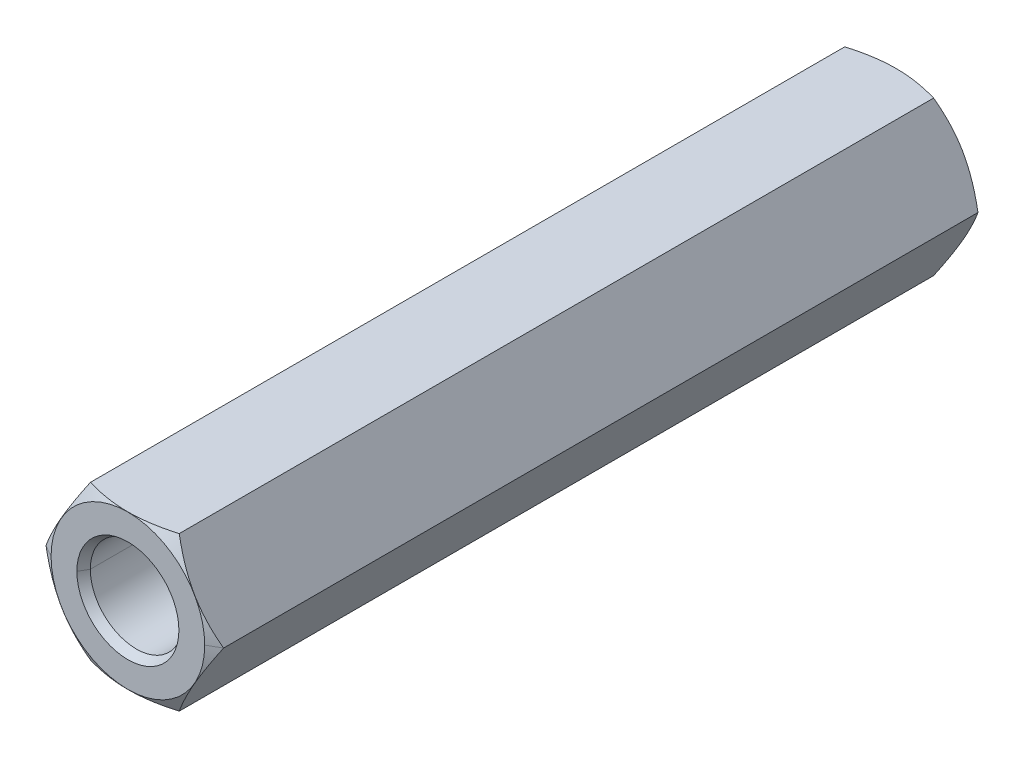
ISO-10303-21;
HEADER;
FILE_DESCRIPTION(('STEP AP214'),'2;1');
FILE_NAME('part.step','',(''),(''),'','','');
FILE_SCHEMA(('AUTOMOTIVE_DESIGN { 1 0 10303 214 1 1 1 1 }'));
ENDSEC;
DATA;
#1=APPLICATION_CONTEXT('core data for automotive mechanical design processes');
#2=APPLICATION_PROTOCOL_DEFINITION('international standard','automotive_design',2000,#1);
#3=PRODUCT_CONTEXT('',#1,'mechanical');
#4=PRODUCT('Part','Part','',(#3));
#5=PRODUCT_RELATED_PRODUCT_CATEGORY('part','',(#4));
#6=PRODUCT_DEFINITION_FORMATION('','',#4);
#7=PRODUCT_DEFINITION_CONTEXT('part definition',#1,'design');
#8=PRODUCT_DEFINITION('design','',#6,#7);
#9=PRODUCT_DEFINITION_SHAPE('','',#8);
#10=(LENGTH_UNIT() NAMED_UNIT(*) SI_UNIT(.MILLI.,.METRE.));
#11=(NAMED_UNIT(*) PLANE_ANGLE_UNIT() SI_UNIT($,.RADIAN.));
#12=(NAMED_UNIT(*) SI_UNIT($,.STERADIAN.) SOLID_ANGLE_UNIT());
#13=UNCERTAINTY_MEASURE_WITH_UNIT(LENGTH_MEASURE(1.E-05),#10,'distance_accuracy_value','');
#14=(GEOMETRIC_REPRESENTATION_CONTEXT(3) GLOBAL_UNCERTAINTY_ASSIGNED_CONTEXT((#13)) GLOBAL_UNIT_ASSIGNED_CONTEXT((#10,
#11,#12)) REPRESENTATION_CONTEXT('',''));
#15=CARTESIAN_POINT('',(0.,0.,0.));
#16=DIRECTION('',(0.,0.,1.));
#17=DIRECTION('',(1.,0.,0.));
#18=AXIS2_PLACEMENT_3D('',#15,#16,#17);
#19=CARTESIAN_POINT('',(220.318744279938,128.56204329235,150.447608312383));
#20=DIRECTION('',(0.,0.,-1.));
#21=DIRECTION('',(1.,0.,0.));
#22=AXIS2_PLACEMENT_3D('',#19,#20,#21);
#23=CONICAL_SURFACE('',#22,1.7320508075705,1.047197551197);
#24=DIRECTION('',(0.86602540378464,0.,-0.499999999999652));
#25=VECTOR('',#24,1.);
#26=CARTESIAN_POINT('',(222.050795087508,128.56204329235,150.447608312383));
#27=LINE('',#26,#25);
#28=CARTESIAN_POINT('',(220.318744279938,128.56204329235,151.447608312383));
#29=VERTEX_POINT('',#28);
#30=CARTESIAN_POINT('',(221.818744279938,128.56204329235,150.581582908599));
#31=VERTEX_POINT('',#30);
#32=EDGE_CURVE('E67',#29,#31,#27,.T.);
#33=ORIENTED_EDGE('',*,*,#32,.F.);
#34=DIRECTION('',(-0.86602540378464,0.,-0.499999999999652));
#35=VECTOR('',#34,1.);
#36=CARTESIAN_POINT('',(218.586693472367,128.56204329235,150.447608312383));
#37=LINE('',#36,#35);
#38=CARTESIAN_POINT('',(218.818744279938,128.56204329235,150.581582908599));
#39=VERTEX_POINT('',#38);
#40=EDGE_CURVE('E11',#29,#39,#37,.T.);
#41=ORIENTED_EDGE('',*,*,#40,.T.);
#42=CARTESIAN_POINT('',(220.318744279938,128.56204329235,150.581582908599));
#43=DIRECTION('',(0.,0.,1.));
#44=DIRECTION('',(1.,0.,0.));
#45=AXIS2_PLACEMENT_3D('',#42,#43,#44);
#46=CIRCLE('',#45,1.5);
#47=EDGE_CURVE('E55',#31,#39,#46,.T.);
#48=ORIENTED_EDGE('',*,*,#47,.F.);
#49=EDGE_LOOP('',(#33,#41,#48));
#50=FACE_BOUND('',#49,.T.);
#51=ADVANCED_FACE('F44',(#50),#23,.F.);
#52=CARTESIAN_POINT('',(220.318744279938,128.56204329235,150.581582908599));
#53=DIRECTION('',(0.,0.,-1.));
#54=DIRECTION('',(1.,0.,0.));
#55=AXIS2_PLACEMENT_3D('',#52,#53,#54);
#56=CYLINDRICAL_SURFACE('',#55,1.5);
#57=ORIENTED_EDGE('',*,*,#47,.T.);
#58=DIRECTION('',(0.,0.,-1.));
#59=VECTOR('',#58,1.);
#60=CARTESIAN_POINT('',(218.818744279938,128.56204329235,150.581582908599));
#61=LINE('',#60,#59);
#62=CARTESIAN_POINT('',(218.818744279938,128.56204329235,140.858711037809));
#63=VERTEX_POINT('',#62);
#64=EDGE_CURVE('E269',#39,#63,#61,.T.);
#65=ORIENTED_EDGE('',*,*,#64,.T.);
#66=CARTESIAN_POINT('',(220.318744279938,128.56204329235,140.858711037809));
#67=DIRECTION('',(0.,0.,1.));
#68=DIRECTION('',(1.,0.,0.));
#69=AXIS2_PLACEMENT_3D('',#66,#67,#68);
#70=CIRCLE('',#69,1.5);
#71=CARTESIAN_POINT('',(221.818744279938,128.56204329235,140.858711037809));
#72=VERTEX_POINT('',#71);
#73=EDGE_CURVE('E300',#72,#63,#70,.T.);
#74=ORIENTED_EDGE('',*,*,#73,.F.);
#75=DIRECTION('',(0.,0.,-1.));
#76=VECTOR('',#75,1.);
#77=CARTESIAN_POINT('',(221.818744279938,128.56204329235,150.581582908599));
#78=LINE('',#77,#76);
#79=EDGE_CURVE('E237',#31,#72,#78,.T.);
#80=ORIENTED_EDGE('',*,*,#79,.F.);
#81=EDGE_LOOP('',(#57,#65,#74,#80));
#82=FACE_BOUND('',#81,.T.);
#83=ADVANCED_FACE('F491',(#82),#56,.F.);
#84=CARTESIAN_POINT('',(220.318744279938,128.56204329235,140.858711037809));
#85=DIRECTION('',(0.,0.,-1.));
#86=DIRECTION('',(1.,0.,0.));
#87=AXIS2_PLACEMENT_3D('',#84,#85,#86);
#88=CONICAL_SURFACE('',#87,1.5,0.5235987756);
#89=ORIENTED_EDGE('',*,*,#73,.T.);
#90=DIRECTION('',(-0.500000000001473,0.,-0.866025403783588));
#91=VECTOR('',#90,1.);
#92=CARTESIAN_POINT('',(218.818744279938,128.56204329235,140.858711037809));
#93=LINE('',#92,#91);
#94=CARTESIAN_POINT('',(218.658744279937,128.56204329235,140.581582908599));
#95=VERTEX_POINT('',#94);
#96=EDGE_CURVE('E307',#63,#95,#93,.T.);
#97=ORIENTED_EDGE('',*,*,#96,.T.);
#98=CARTESIAN_POINT('',(220.318744279938,128.56204329235,140.581582908599));
#99=DIRECTION('',(0.,0.,1.));
#100=DIRECTION('',(1.,0.,0.));
#101=AXIS2_PLACEMENT_3D('',#98,#99,#100);
#102=CIRCLE('',#101,1.66);
#103=CARTESIAN_POINT('',(221.978744279938,128.56204329235,140.581582908599));
#104=VERTEX_POINT('',#103);
#105=EDGE_CURVE('E274',#104,#95,#102,.T.);
#106=ORIENTED_EDGE('',*,*,#105,.F.);
#107=DIRECTION('',(0.500000000001473,0.,-0.866025403783588));
#108=VECTOR('',#107,1.);
#109=CARTESIAN_POINT('',(221.818744279938,128.56204329235,140.858711037809));
#110=LINE('',#109,#108);
#111=EDGE_CURVE('E236',#72,#104,#110,.T.);
#112=ORIENTED_EDGE('',*,*,#111,.F.);
#113=EDGE_LOOP('',(#89,#97,#106,#112));
#114=FACE_BOUND('',#113,.T.);
#115=ADVANCED_FACE('F496',(#114),#88,.F.);
#116=CARTESIAN_POINT('',(220.318744279938,128.56204329235,140.581582908599));
#117=DIRECTION('',(0.,0.,1.));
#118=DIRECTION('',(1.,0.,0.));
#119=AXIS2_PLACEMENT_3D('',#116,#117,#118);
#120=CONICAL_SURFACE('',#119,2.5,1.047197551197);
#121=CARTESIAN_POINT('',(220.318744279938,128.56204329235,140.581582908599));
#122=DIRECTION('',(0.,0.,1.));
#123=DIRECTION('',(1.,0.,0.));
#124=AXIS2_PLACEMENT_3D('',#121,#122,#123);
#125=CIRCLE('',#124,2.5);
#126=CARTESIAN_POINT('',(222.818744279938,128.56204329235,140.581582908599));
#127=VERTEX_POINT('',#126);
#128=CARTESIAN_POINT('',(217.818744279938,128.56204329235,140.581582908599));
#129=VERTEX_POINT('',#128);
#130=EDGE_CURVE('E244',#127,#129,#125,.T.);
#131=ORIENTED_EDGE('',*,*,#130,.T.);
#132=DIRECTION('',(-0.86602540378464,0.,0.499999999999652));
#133=VECTOR('',#132,1.);
#134=CARTESIAN_POINT('',(217.818744279938,128.56204329235,140.581582908599));
#135=LINE('',#134,#133);
#136=CARTESIAN_POINT('',(217.428744279937,128.56204329235,140.806749513583));
#137=VERTEX_POINT('',#136);
#138=EDGE_CURVE('E186',#129,#137,#135,.T.);
#139=ORIENTED_EDGE('',*,*,#138,.T.);
#140=CARTESIAN_POINT('',(218.873744279938,131.064856709287,140.806749513583));
#141=CARTESIAN_POINT('',(218.151244279938,129.813450000819,140.389613944093));
#142=CARTESIAN_POINT('',(217.428744279937,128.56204329235,140.806749513583));
#143=(BOUNDED_CURVE() B_SPLINE_CURVE(2,(#140,#141,#142),.UNSPECIFIED.,.F.,
.F.) B_SPLINE_CURVE_WITH_KNOTS((3,3),(0.,1.),
.UNSPECIFIED.) CURVE() GEOMETRIC_REPRESENTATION_ITEM() RATIONAL_B_SPLINE_CURVE((1.,
1.15470053837935,1.)) REPRESENTATION_ITEM(''));
#144=CARTESIAN_POINT('',(218.873744279938,131.064856709287,140.806749513583));
#145=VERTEX_POINT('',#144);
#146=EDGE_CURVE('E183',#145,#137,#143,.T.);
#147=ORIENTED_EDGE('',*,*,#146,.F.);
#148=CARTESIAN_POINT('',(221.763744279937,131.064856709287,140.806749513583));
#149=CARTESIAN_POINT('',(220.318744279938,131.064856709288,140.389613944093));
#150=CARTESIAN_POINT('',(218.873744279938,131.064856709287,140.806749513583));
#151=(BOUNDED_CURVE() B_SPLINE_CURVE(2,(#148,#149,#150),.UNSPECIFIED.,.F.,
.F.) B_SPLINE_CURVE_WITH_KNOTS((3,3),(0.,1.),
.UNSPECIFIED.) CURVE() GEOMETRIC_REPRESENTATION_ITEM() RATIONAL_B_SPLINE_CURVE((1.,
1.15470053837926,1.)) REPRESENTATION_ITEM(''));
#152=CARTESIAN_POINT('',(221.763744279937,131.064856709287,140.806749513583));
#153=VERTEX_POINT('',#152);
#154=EDGE_CURVE('E170',#153,#145,#151,.T.);
#155=ORIENTED_EDGE('',*,*,#154,.F.);
#156=CARTESIAN_POINT('',(223.208744279937,128.56204329235,140.806749513583));
#157=CARTESIAN_POINT('',(222.486244279938,129.813450000819,140.389613944093));
#158=CARTESIAN_POINT('',(221.763744279937,131.064856709287,140.806749513583));
#159=(BOUNDED_CURVE() B_SPLINE_CURVE(2,(#156,#157,#158),.UNSPECIFIED.,.F.,
.F.) B_SPLINE_CURVE_WITH_KNOTS((3,3),(0.,1.),
.UNSPECIFIED.) CURVE() GEOMETRIC_REPRESENTATION_ITEM() RATIONAL_B_SPLINE_CURVE((1.,
1.15470053837946,1.)) REPRESENTATION_ITEM(''));
#160=CARTESIAN_POINT('',(223.208744279937,128.56204329235,140.806749513583));
#161=VERTEX_POINT('',#160);
#162=EDGE_CURVE('E210',#161,#153,#159,.T.);
#163=ORIENTED_EDGE('',*,*,#162,.F.);
#164=DIRECTION('',(0.86602540378464,0.,0.499999999999652));
#165=VECTOR('',#164,1.);
#166=CARTESIAN_POINT('',(222.818744279938,128.56204329235,140.581582908599));
#167=LINE('',#166,#165);
#168=EDGE_CURVE('E270',#127,#161,#167,.T.);
#169=ORIENTED_EDGE('',*,*,#168,.F.);
#170=EDGE_LOOP('',(#131,#139,#147,#155,#163,#169));
#171=FACE_BOUND('',#170,.T.);
#172=ADVANCED_FACE('F185',(#171),#120,.T.);
#173=CARTESIAN_POINT('',(220.318744279938,128.56204329235,165.356416303615));
#174=DIRECTION('',(0.,0.,-1.));
#175=DIRECTION('',(1.,0.,0.));
#176=AXIS2_PLACEMENT_3D('',#173,#174,#175);
#177=CONICAL_SURFACE('',#176,2.89,1.047197551197);
#178=CARTESIAN_POINT('',(220.318744279938,128.56204329235,165.581582908599));
#179=DIRECTION('',(0.,0.,1.));
#180=DIRECTION('',(1.,0.,0.));
#181=AXIS2_PLACEMENT_3D('',#178,#179,#180);
#182=CIRCLE('',#181,2.5);
#183=CARTESIAN_POINT('',(217.818744279938,128.56204329235,165.581582908599));
#184=VERTEX_POINT('',#183);
#185=CARTESIAN_POINT('',(222.818744279938,128.56204329235,165.581582908599));
#186=VERTEX_POINT('',#185);
#187=EDGE_CURVE('E256',#184,#186,#182,.T.);
#188=ORIENTED_EDGE('',*,*,#187,.F.);
#189=DIRECTION('',(-0.86602540378464,0.,-0.499999999999652));
#190=VECTOR('',#189,1.);
#191=CARTESIAN_POINT('',(217.428744279937,128.56204329235,165.356416303615));
#192=LINE('',#191,#190);
#193=CARTESIAN_POINT('',(217.428744279937,128.56204329235,165.356416303615));
#194=VERTEX_POINT('',#193);
#195=EDGE_CURVE('E245',#184,#194,#192,.T.);
#196=ORIENTED_EDGE('',*,*,#195,.T.);
#197=CARTESIAN_POINT('',(218.873744279938,126.059229875413,165.356416303615));
#198=CARTESIAN_POINT('',(218.151244279937,127.310636583881,165.773551873104));
#199=CARTESIAN_POINT('',(217.428744279937,128.56204329235,165.356416303615));
#200=(BOUNDED_CURVE() B_SPLINE_CURVE(2,(#197,#198,#199),.UNSPECIFIED.,.F.,
.F.) B_SPLINE_CURVE_WITH_KNOTS((3,3),(0.,1.),
.UNSPECIFIED.) CURVE() GEOMETRIC_REPRESENTATION_ITEM() RATIONAL_B_SPLINE_CURVE((1.,
1.15470053837936,1.)) REPRESENTATION_ITEM(''));
#201=CARTESIAN_POINT('',(218.873744279938,126.059229875413,165.356416303615));
#202=VERTEX_POINT('',#201);
#203=EDGE_CURVE('E216',#202,#194,#200,.T.);
#204=ORIENTED_EDGE('',*,*,#203,.F.);
#205=CARTESIAN_POINT('',(221.763744279937,126.059229875413,165.356416303615));
#206=CARTESIAN_POINT('',(220.318744279938,126.059229875413,165.773551873104));
#207=CARTESIAN_POINT('',(218.873744279938,126.059229875413,165.356416303615));
#208=(BOUNDED_CURVE() B_SPLINE_CURVE(2,(#205,#206,#207),.UNSPECIFIED.,.F.,
.F.) B_SPLINE_CURVE_WITH_KNOTS((3,3),(0.,1.),
.UNSPECIFIED.) CURVE() GEOMETRIC_REPRESENTATION_ITEM() RATIONAL_B_SPLINE_CURVE((1.,
1.15470053837925,1.)) REPRESENTATION_ITEM(''));
#209=CARTESIAN_POINT('',(221.763744279937,126.059229875413,165.356416303615));
#210=VERTEX_POINT('',#209);
#211=EDGE_CURVE('E90',#210,#202,#208,.T.);
#212=ORIENTED_EDGE('',*,*,#211,.F.);
#213=CARTESIAN_POINT('',(223.208744279937,128.56204329235,165.356416303615));
#214=CARTESIAN_POINT('',(222.486244279938,127.310636583882,165.773551873105));
#215=CARTESIAN_POINT('',(221.763744279937,126.059229875413,165.356416303615));
#216=(BOUNDED_CURVE() B_SPLINE_CURVE(2,(#213,#214,#215),.UNSPECIFIED.,.F.,
.F.) B_SPLINE_CURVE_WITH_KNOTS((3,3),(0.,1.),
.UNSPECIFIED.) CURVE() GEOMETRIC_REPRESENTATION_ITEM() RATIONAL_B_SPLINE_CURVE((1.,
1.15470053837944,1.)) REPRESENTATION_ITEM(''));
#217=CARTESIAN_POINT('',(223.208744279937,128.56204329235,165.356416303615));
#218=VERTEX_POINT('',#217);
#219=EDGE_CURVE('E231',#218,#210,#216,.T.);
#220=ORIENTED_EDGE('',*,*,#219,.F.);
#221=DIRECTION('',(0.86602540378464,0.,-0.499999999999652));
#222=VECTOR('',#221,1.);
#223=CARTESIAN_POINT('',(223.208744279937,128.56204329235,165.356416303615));
#224=LINE('',#223,#222);
#225=EDGE_CURVE('E230',#186,#218,#224,.T.);
#226=ORIENTED_EDGE('',*,*,#225,.F.);
#227=EDGE_LOOP('',(#188,#196,#204,#212,#220,#226));
#228=FACE_BOUND('',#227,.T.);
#229=ADVANCED_FACE('F456',(#228),#177,.T.);
#230=CARTESIAN_POINT('',(220.318744279938,128.56204329235,165.581582908599));
#231=DIRECTION('',(0.,0.,1.));
#232=DIRECTION('',(1.,0.,0.));
#233=AXIS2_PLACEMENT_3D('',#230,#231,#232);
#234=CONICAL_SURFACE('',#233,1.65999999999899,0.523598775598);
#235=CARTESIAN_POINT('',(220.318744279938,128.56204329235,165.304454779388));
#236=DIRECTION('',(0.,0.,1.));
#237=DIRECTION('',(1.,0.,0.));
#238=AXIS2_PLACEMENT_3D('',#235,#236,#237);
#239=CIRCLE('',#238,1.5);
#240=CARTESIAN_POINT('',(218.818744279938,128.56204329235,165.304454779388));
#241=VERTEX_POINT('',#240);
#242=CARTESIAN_POINT('',(221.818744279938,128.56204329235,165.304454779388));
#243=VERTEX_POINT('',#242);
#244=EDGE_CURVE('E249',#241,#243,#239,.T.);
#245=ORIENTED_EDGE('',*,*,#244,.F.);
#246=DIRECTION('',(-0.499999999999741,0.,0.866025403784588));
#247=VECTOR('',#246,1.);
#248=CARTESIAN_POINT('',(218.658744279938,128.56204329235,165.581582908599));
#249=LINE('',#248,#247);
#250=CARTESIAN_POINT('',(218.658744279938,128.56204329235,165.581582908599));
#251=VERTEX_POINT('',#250);
#252=EDGE_CURVE('E390',#241,#251,#249,.T.);
#253=ORIENTED_EDGE('',*,*,#252,.T.);
#254=CARTESIAN_POINT('',(220.318744279938,128.56204329235,165.581582908599));
#255=DIRECTION('',(0.,0.,1.));
#256=DIRECTION('',(1.,0.,0.));
#257=AXIS2_PLACEMENT_3D('',#254,#255,#256);
#258=CIRCLE('',#257,1.65999999999899);
#259=CARTESIAN_POINT('',(221.978744279937,128.56204329235,165.581582908599));
#260=VERTEX_POINT('',#259);
#261=EDGE_CURVE('E381',#251,#260,#258,.T.);
#262=ORIENTED_EDGE('',*,*,#261,.T.);
#263=DIRECTION('',(0.499999999999741,0.,0.866025403784588));
#264=VECTOR('',#263,1.);
#265=CARTESIAN_POINT('',(221.978744279937,128.56204329235,165.581582908599));
#266=LINE('',#265,#264);
#267=EDGE_CURVE('E250',#243,#260,#266,.T.);
#268=ORIENTED_EDGE('',*,*,#267,.F.);
#269=EDGE_LOOP('',(#245,#253,#262,#268));
#270=FACE_BOUND('',#269,.T.);
#271=ADVANCED_FACE('F474',(#270),#234,.F.);
#272=CARTESIAN_POINT('',(220.318744279938,128.56204329235,165.304454779388));
#273=DIRECTION('',(0.,0.,-1.));
#274=DIRECTION('',(1.,0.,0.));
#275=AXIS2_PLACEMENT_3D('',#272,#273,#274);
#276=CYLINDRICAL_SURFACE('',#275,1.5);
#277=CARTESIAN_POINT('',(220.318744279938,128.56204329235,165.304454779388));
#278=DIRECTION('',(0.,0.,1.));
#279=DIRECTION('',(1.,0.,0.));
#280=AXIS2_PLACEMENT_3D('',#277,#278,#279);
#281=CIRCLE('',#280,1.5);
#282=EDGE_CURVE('E318',#243,#241,#281,.T.);
#283=ORIENTED_EDGE('',*,*,#282,.T.);
#284=DIRECTION('',(0.,0.,-1.));
#285=VECTOR('',#284,1.);
#286=CARTESIAN_POINT('',(218.818744279938,128.56204329235,165.304454779388));
#287=LINE('',#286,#285);
#288=CARTESIAN_POINT('',(218.818744279938,128.56204329235,155.581582908599));
#289=VERTEX_POINT('',#288);
#290=EDGE_CURVE('E314',#241,#289,#287,.T.);
#291=ORIENTED_EDGE('',*,*,#290,.T.);
#292=CARTESIAN_POINT('',(220.318744279938,128.56204329235,155.581582908599));
#293=DIRECTION('',(0.,0.,1.));
#294=DIRECTION('',(1.,0.,0.));
#295=AXIS2_PLACEMENT_3D('',#292,#293,#294);
#296=CIRCLE('',#295,1.5);
#297=CARTESIAN_POINT('',(221.818744279938,128.56204329235,155.581582908599));
#298=VERTEX_POINT('',#297);
#299=EDGE_CURVE('E368',#298,#289,#296,.T.);
#300=ORIENTED_EDGE('',*,*,#299,.F.);
#301=DIRECTION('',(0.,0.,-1.));
#302=VECTOR('',#301,1.);
#303=CARTESIAN_POINT('',(221.818744279938,128.56204329235,165.304454779388));
#304=LINE('',#303,#302);
#305=EDGE_CURVE('E246',#243,#298,#304,.T.);
#306=ORIENTED_EDGE('',*,*,#305,.F.);
#307=EDGE_LOOP('',(#283,#291,#300,#306));
#308=FACE_BOUND('',#307,.T.);
#309=ADVANCED_FACE('F478',(#308),#276,.F.);
#310=CARTESIAN_POINT('',(220.318744279938,128.56204329235,155.581582908599));
#311=DIRECTION('',(0.,0.,1.));
#312=DIRECTION('',(1.,0.,0.));
#313=AXIS2_PLACEMENT_3D('',#310,#311,#312);
#314=CONICAL_SURFACE('',#313,1.5,1.047197551197);
#315=DIRECTION('',(0.86602540378464,0.,0.499999999999652));
#316=VECTOR('',#315,1.);
#317=CARTESIAN_POINT('',(221.818744279938,128.56204329235,155.581582908599));
#318=LINE('',#317,#316);
#319=CARTESIAN_POINT('',(220.318744279938,128.56204329235,154.715557504813));
#320=VERTEX_POINT('',#319);
#321=EDGE_CURVE('E361',#320,#298,#318,.T.);
#322=ORIENTED_EDGE('',*,*,#321,.F.);
#323=DIRECTION('',(-0.86602540378464,0.,0.499999999999652));
#324=VECTOR('',#323,1.);
#325=CARTESIAN_POINT('',(218.818744279938,128.56204329235,155.581582908599));
#326=LINE('',#325,#324);
#327=EDGE_CURVE('E319',#320,#289,#326,.T.);
#328=ORIENTED_EDGE('',*,*,#327,.T.);
#329=CARTESIAN_POINT('',(220.318744279938,128.56204329235,155.581582908599));
#330=DIRECTION('',(0.,0.,1.));
#331=DIRECTION('',(1.,0.,0.));
#332=AXIS2_PLACEMENT_3D('',#329,#330,#331);
#333=CIRCLE('',#332,1.5);
#334=EDGE_CURVE('E365',#289,#298,#333,.T.);
#335=ORIENTED_EDGE('',*,*,#334,.T.);
#336=EDGE_LOOP('',(#322,#328,#335));
#337=FACE_BOUND('',#336,.T.);
#338=ADVANCED_FACE('F363',(#337),#314,.F.);
#339=CARTESIAN_POINT('',(220.318744279938,128.56204329235,155.581582908599));
#340=DIRECTION('',(0.,0.,1.));
#341=DIRECTION('',(1.,0.,0.));
#342=AXIS2_PLACEMENT_3D('',#339,#340,#341);
#343=CONICAL_SURFACE('',#342,1.5,1.047197551197);
#344=ORIENTED_EDGE('',*,*,#327,.F.);
#345=ORIENTED_EDGE('',*,*,#321,.T.);
#346=ORIENTED_EDGE('',*,*,#299,.T.);
#347=EDGE_LOOP('',(#344,#345,#346));
#348=FACE_BOUND('',#347,.T.);
#349=ADVANCED_FACE('F370',(#348),#343,.F.);
#350=CARTESIAN_POINT('',(220.318744279938,128.56204329235,165.304454779388));
#351=DIRECTION('',(0.,0.,-1.));
#352=DIRECTION('',(1.,0.,0.));
#353=AXIS2_PLACEMENT_3D('',#350,#351,#352);
#354=CYLINDRICAL_SURFACE('',#353,1.5);
#355=ORIENTED_EDGE('',*,*,#290,.F.);
#356=ORIENTED_EDGE('',*,*,#244,.T.);
#357=ORIENTED_EDGE('',*,*,#305,.T.);
#358=ORIENTED_EDGE('',*,*,#334,.F.);
#359=EDGE_LOOP('',(#355,#356,#357,#358));
#360=FACE_BOUND('',#359,.T.);
#361=ADVANCED_FACE('F479',(#360),#354,.F.);
#362=CARTESIAN_POINT('',(220.318744279938,128.56204329235,165.581582908599));
#363=DIRECTION('',(0.,0.,1.));
#364=DIRECTION('',(1.,0.,0.));
#365=AXIS2_PLACEMENT_3D('',#362,#363,#364);
#366=CONICAL_SURFACE('',#365,1.65999999999899,0.523598775598);
#367=ORIENTED_EDGE('',*,*,#252,.F.);
#368=ORIENTED_EDGE('',*,*,#282,.F.);
#369=ORIENTED_EDGE('',*,*,#267,.T.);
#370=CARTESIAN_POINT('',(220.318744279938,128.56204329235,165.581582908599));
#371=DIRECTION('',(0.,0.,1.));
#372=DIRECTION('',(1.,0.,0.));
#373=AXIS2_PLACEMENT_3D('',#370,#371,#372);
#374=CIRCLE('',#373,1.65999999999899);
#375=EDGE_CURVE('E255',#260,#251,#374,.T.);
#376=ORIENTED_EDGE('',*,*,#375,.T.);
#377=EDGE_LOOP('',(#367,#368,#369,#376));
#378=FACE_BOUND('',#377,.T.);
#379=ADVANCED_FACE('F461',(#378),#366,.F.);
#380=CARTESIAN_POINT('',(220.318744279938,128.56204329235,165.581582908599));
#381=DIRECTION('',(0.,0.,1.));
#382=DIRECTION('',(1.,0.,0.));
#383=AXIS2_PLACEMENT_3D('',#380,#381,#382);
#384=PLANE('',#383);
#385=CARTESIAN_POINT('',(220.318744279938,128.56204329235,165.581582908599));
#386=DIRECTION('',(0.,0.,1.));
#387=DIRECTION('',(1.,0.,0.));
#388=AXIS2_PLACEMENT_3D('',#385,#386,#387);
#389=CIRCLE('',#388,2.5);
#390=EDGE_CURVE('E251',#186,#184,#389,.T.);
#391=ORIENTED_EDGE('',*,*,#390,.T.);
#392=ORIENTED_EDGE('',*,*,#187,.T.);
#393=EDGE_LOOP('',(#391,#392));
#394=FACE_BOUND('',#393,.T.);
#395=ORIENTED_EDGE('',*,*,#375,.F.);
#396=ORIENTED_EDGE('',*,*,#261,.F.);
#397=EDGE_LOOP('',(#395,#396));
#398=FACE_BOUND('',#397,.T.);
#399=ADVANCED_FACE('F458',(#394,#398),#384,.T.);
#400=CARTESIAN_POINT('',(220.318744279938,128.56204329235,165.356416303615));
#401=DIRECTION('',(0.,0.,-1.));
#402=DIRECTION('',(1.,0.,0.));
#403=AXIS2_PLACEMENT_3D('',#400,#401,#402);
#404=CONICAL_SURFACE('',#403,2.89,1.047197551197);
#405=ORIENTED_EDGE('',*,*,#195,.F.);
#406=ORIENTED_EDGE('',*,*,#390,.F.);
#407=ORIENTED_EDGE('',*,*,#225,.T.);
#408=CARTESIAN_POINT('',(221.763744279937,131.064856709287,165.356416303615));
#409=CARTESIAN_POINT('',(222.486244279938,129.813450000819,165.773551873104));
#410=CARTESIAN_POINT('',(223.208744279937,128.56204329235,165.356416303615));
#411=(BOUNDED_CURVE() B_SPLINE_CURVE(2,(#408,#409,#410),.UNSPECIFIED.,.F.,
.F.) B_SPLINE_CURVE_WITH_KNOTS((3,3),(0.,1.),
.UNSPECIFIED.) CURVE() GEOMETRIC_REPRESENTATION_ITEM() RATIONAL_B_SPLINE_CURVE((1.,
1.15470053837935,1.)) REPRESENTATION_ITEM(''));
#412=CARTESIAN_POINT('',(221.763744279937,131.064856709287,165.356416303615));
#413=VERTEX_POINT('',#412);
#414=EDGE_CURVE('E104',#413,#218,#411,.T.);
#415=ORIENTED_EDGE('',*,*,#414,.F.);
#416=CARTESIAN_POINT('',(218.873744279938,131.064856709287,165.356416303615));
#417=CARTESIAN_POINT('',(220.318744279937,131.064856709287,165.773551873104));
#418=CARTESIAN_POINT('',(221.763744279937,131.064856709287,165.356416303615));
#419=(BOUNDED_CURVE() B_SPLINE_CURVE(2,(#416,#417,#418),.UNSPECIFIED.,.F.,
.F.) B_SPLINE_CURVE_WITH_KNOTS((3,3),(0.,1.),
.UNSPECIFIED.) CURVE() GEOMETRIC_REPRESENTATION_ITEM() RATIONAL_B_SPLINE_CURVE((1.,
1.15470053837925,1.)) REPRESENTATION_ITEM(''));
#420=CARTESIAN_POINT('',(218.873744279938,131.064856709287,165.356416303615));
#421=VERTEX_POINT('',#420);
#422=EDGE_CURVE('E180',#421,#413,#419,.T.);
#423=ORIENTED_EDGE('',*,*,#422,.F.);
#424=CARTESIAN_POINT('',(217.428744279937,128.56204329235,165.356416303615));
#425=CARTESIAN_POINT('',(218.151244279937,129.813450000819,165.773551873104));
#426=CARTESIAN_POINT('',(218.873744279938,131.064856709287,165.356416303615));
#427=(BOUNDED_CURVE() B_SPLINE_CURVE(2,(#424,#425,#426),.UNSPECIFIED.,.F.,
.F.) B_SPLINE_CURVE_WITH_KNOTS((3,3),(0.,1.),
.UNSPECIFIED.) CURVE() GEOMETRIC_REPRESENTATION_ITEM() RATIONAL_B_SPLINE_CURVE((1.,
1.15470053837944,1.)) REPRESENTATION_ITEM(''));
#428=EDGE_CURVE('E192',#194,#421,#427,.T.);
#429=ORIENTED_EDGE('',*,*,#428,.F.);
#430=EDGE_LOOP('',(#405,#406,#407,#415,#423,#429));
#431=FACE_BOUND('',#430,.T.);
#432=ADVANCED_FACE('F327',(#431),#404,.T.);
#433=CARTESIAN_POINT('',(221.763744279937,126.059229875413,140.581582908599));
#434=DIRECTION('',(-0.866025403784329,0.50000000000019,0.));
#435=DIRECTION('',(0.,0.,1.));
#436=AXIS2_PLACEMENT_3D('',#433,#434,#435);
#437=PLANE('',#436);
#438=DIRECTION('',(0.,0.,1.));
#439=VECTOR('',#438,1.);
#440=CARTESIAN_POINT('',(223.208744279937,128.56204329235,140.806749513583));
#441=LINE('',#440,#439);
#442=EDGE_CURVE('E223',#161,#218,#441,.T.);
#443=ORIENTED_EDGE('',*,*,#442,.T.);
#444=ORIENTED_EDGE('',*,*,#219,.T.);
#445=DIRECTION('',(0.,0.,1.));
#446=VECTOR('',#445,1.);
#447=CARTESIAN_POINT('',(221.763744279937,126.059229875413,140.581582908599));
#448=LINE('',#447,#446);
#449=CARTESIAN_POINT('',(221.763744279937,126.059229875413,140.806749513583));
#450=VERTEX_POINT('',#449);
#451=EDGE_CURVE('E263',#450,#210,#448,.T.);
#452=ORIENTED_EDGE('',*,*,#451,.F.);
#453=CARTESIAN_POINT('',(221.763744279937,126.059229875413,140.806749513583));
#454=CARTESIAN_POINT('',(222.486244279938,127.310636583881,140.389613944093));
#455=CARTESIAN_POINT('',(223.208744279937,128.56204329235,140.806749513583));
#456=(BOUNDED_CURVE() B_SPLINE_CURVE(2,(#453,#454,#455),.UNSPECIFIED.,.F.,
.F.) B_SPLINE_CURVE_WITH_KNOTS((3,3),(0.,1.),
.UNSPECIFIED.) CURVE() GEOMETRIC_REPRESENTATION_ITEM() RATIONAL_B_SPLINE_CURVE((1.,
1.15470053837935,1.)) REPRESENTATION_ITEM(''));
#457=EDGE_CURVE('E257',#450,#161,#456,.T.);
#458=ORIENTED_EDGE('',*,*,#457,.T.);
#459=EDGE_LOOP('',(#443,#444,#452,#458));
#460=FACE_BOUND('',#459,.T.);
#461=ADVANCED_FACE('F330',(#460),#437,.F.);
#462=CARTESIAN_POINT('',(218.873744279938,126.059229875413,140.581582908599));
#463=DIRECTION('',(0.,1.,0.));
#464=DIRECTION('',(1.,0.,0.));
#465=AXIS2_PLACEMENT_3D('',#462,#463,#464);
#466=PLANE('',#465);
#467=ORIENTED_EDGE('',*,*,#451,.T.);
#468=ORIENTED_EDGE('',*,*,#211,.T.);
#469=DIRECTION('',(0.,0.,1.));
#470=VECTOR('',#469,1.);
#471=CARTESIAN_POINT('',(218.873744279938,126.059229875413,140.581582908599));
#472=LINE('',#471,#470);
#473=CARTESIAN_POINT('',(218.873744279938,126.059229875413,140.806749513583));
#474=VERTEX_POINT('',#473);
#475=EDGE_CURVE('E205',#474,#202,#472,.T.);
#476=ORIENTED_EDGE('',*,*,#475,.F.);
#477=CARTESIAN_POINT('',(218.873744279938,126.059229875413,140.806749513583));
#478=CARTESIAN_POINT('',(220.318744279938,126.059229875413,140.389613944093));
#479=CARTESIAN_POINT('',(221.763744279937,126.059229875413,140.806749513583));
#480=(BOUNDED_CURVE() B_SPLINE_CURVE(2,(#477,#478,#479),.UNSPECIFIED.,.F.,
.F.) B_SPLINE_CURVE_WITH_KNOTS((3,3),(0.,1.),
.UNSPECIFIED.) CURVE() GEOMETRIC_REPRESENTATION_ITEM() RATIONAL_B_SPLINE_CURVE((1.,
1.15470053837926,1.)) REPRESENTATION_ITEM(''));
#481=EDGE_CURVE('E295',#474,#450,#480,.T.);
#482=ORIENTED_EDGE('',*,*,#481,.T.);
#483=EDGE_LOOP('',(#467,#468,#476,#482));
#484=FACE_BOUND('',#483,.T.);
#485=ADVANCED_FACE('F453',(#484),#466,.F.);
#486=CARTESIAN_POINT('',(217.428744279937,128.56204329235,140.581582908599));
#487=DIRECTION('',(0.866025403784329,0.50000000000019,0.));
#488=DIRECTION('',(0.,0.,-1.));
#489=AXIS2_PLACEMENT_3D('',#486,#487,#488);
#490=PLANE('',#489);
#491=ORIENTED_EDGE('',*,*,#475,.T.);
#492=ORIENTED_EDGE('',*,*,#203,.T.);
#493=DIRECTION('',(0.,0.,1.));
#494=VECTOR('',#493,1.);
#495=CARTESIAN_POINT('',(217.428744279937,128.56204329235,140.581582908599));
#496=LINE('',#495,#494);
#497=EDGE_CURVE('E404',#137,#194,#496,.T.);
#498=ORIENTED_EDGE('',*,*,#497,.F.);
#499=CARTESIAN_POINT('',(217.428744279937,128.56204329235,140.806749513583));
#500=CARTESIAN_POINT('',(218.151244279937,127.310636583882,140.389613944093));
#501=CARTESIAN_POINT('',(218.873744279938,126.059229875413,140.806749513583));
#502=(BOUNDED_CURVE() B_SPLINE_CURVE(2,(#499,#500,#501),.UNSPECIFIED.,.F.,
.F.) B_SPLINE_CURVE_WITH_KNOTS((3,3),(0.,1.),
.UNSPECIFIED.) CURVE() GEOMETRIC_REPRESENTATION_ITEM() RATIONAL_B_SPLINE_CURVE((1.,
1.15470053837945,1.)) REPRESENTATION_ITEM(''));
#503=EDGE_CURVE('E222',#137,#474,#502,.T.);
#504=ORIENTED_EDGE('',*,*,#503,.T.);
#505=EDGE_LOOP('',(#491,#492,#498,#504));
#506=FACE_BOUND('',#505,.T.);
#507=ADVANCED_FACE('F454',(#506),#490,.F.);
#508=CARTESIAN_POINT('',(218.873744279938,131.064856709287,140.581582908599));
#509=DIRECTION('',(0.866025403784329,-0.50000000000019,0.));
#510=DIRECTION('',(0.,0.,-1.));
#511=AXIS2_PLACEMENT_3D('',#508,#509,#510);
#512=PLANE('',#511);
#513=ORIENTED_EDGE('',*,*,#497,.T.);
#514=ORIENTED_EDGE('',*,*,#428,.T.);
#515=DIRECTION('',(0.,0.,1.));
#516=VECTOR('',#515,1.);
#517=CARTESIAN_POINT('',(218.873744279938,131.064856709287,140.581582908599));
#518=LINE('',#517,#516);
#519=EDGE_CURVE('E175',#145,#421,#518,.T.);
#520=ORIENTED_EDGE('',*,*,#519,.F.);
#521=ORIENTED_EDGE('',*,*,#146,.T.);
#522=EDGE_LOOP('',(#513,#514,#520,#521));
#523=FACE_BOUND('',#522,.T.);
#524=ADVANCED_FACE('F195',(#523),#512,.F.);
#525=CARTESIAN_POINT('',(221.763744279937,131.064856709287,140.581582908599));
#526=DIRECTION('',(0.,-1.,0.));
#527=DIRECTION('',(-1.,0.,0.));
#528=AXIS2_PLACEMENT_3D('',#525,#526,#527);
#529=PLANE('',#528);
#530=ORIENTED_EDGE('',*,*,#519,.T.);
#531=ORIENTED_EDGE('',*,*,#422,.T.);
#532=DIRECTION('',(0.,0.,1.));
#533=VECTOR('',#532,1.);
#534=CARTESIAN_POINT('',(221.763744279937,131.064856709287,140.581582908599));
#535=LINE('',#534,#533);
#536=EDGE_CURVE('E176',#153,#413,#535,.T.);
#537=ORIENTED_EDGE('',*,*,#536,.F.);
#538=ORIENTED_EDGE('',*,*,#154,.T.);
#539=EDGE_LOOP('',(#530,#531,#537,#538));
#540=FACE_BOUND('',#539,.T.);
#541=ADVANCED_FACE('F172',(#540),#529,.F.);
#542=CARTESIAN_POINT('',(223.208744279937,128.56204329235,140.581582908599));
#543=DIRECTION('',(-0.866025403784329,-0.50000000000019,0.));
#544=DIRECTION('',(-0.50000000000019,0.866025403784329,0.));
#545=AXIS2_PLACEMENT_3D('',#542,#543,#544);
#546=PLANE('',#545);
#547=ORIENTED_EDGE('',*,*,#536,.T.);
#548=ORIENTED_EDGE('',*,*,#414,.T.);
#549=ORIENTED_EDGE('',*,*,#442,.F.);
#550=ORIENTED_EDGE('',*,*,#162,.T.);
#551=EDGE_LOOP('',(#547,#548,#549,#550));
#552=FACE_BOUND('',#551,.T.);
#553=ADVANCED_FACE('F332',(#552),#546,.F.);
#554=CARTESIAN_POINT('',(220.318744279938,128.56204329235,140.581582908599));
#555=DIRECTION('',(0.,0.,1.));
#556=DIRECTION('',(1.,0.,0.));
#557=AXIS2_PLACEMENT_3D('',#554,#555,#556);
#558=CONICAL_SURFACE('',#557,2.5,1.047197551197);
#559=ORIENTED_EDGE('',*,*,#138,.F.);
#560=CARTESIAN_POINT('',(220.318744279938,128.56204329235,140.581582908599));
#561=DIRECTION('',(0.,0.,1.));
#562=DIRECTION('',(1.,0.,0.));
#563=AXIS2_PLACEMENT_3D('',#560,#561,#562);
#564=CIRCLE('',#563,2.5);
#565=EDGE_CURVE('E273',#129,#127,#564,.T.);
#566=ORIENTED_EDGE('',*,*,#565,.T.);
#567=ORIENTED_EDGE('',*,*,#168,.T.);
#568=ORIENTED_EDGE('',*,*,#457,.F.);
#569=ORIENTED_EDGE('',*,*,#481,.F.);
#570=ORIENTED_EDGE('',*,*,#503,.F.);
#571=EDGE_LOOP('',(#559,#566,#567,#568,#569,#570));
#572=FACE_BOUND('',#571,.T.);
#573=ADVANCED_FACE('F46',(#572),#558,.T.);
#574=CARTESIAN_POINT('',(220.318744279938,128.56204329235,140.581582908599));
#575=DIRECTION('',(0.,0.,1.));
#576=DIRECTION('',(1.,0.,0.));
#577=AXIS2_PLACEMENT_3D('',#574,#575,#576);
#578=PLANE('',#577);
#579=ORIENTED_EDGE('',*,*,#130,.F.);
#580=ORIENTED_EDGE('',*,*,#565,.F.);
#581=EDGE_LOOP('',(#579,#580));
#582=FACE_BOUND('',#581,.T.);
#583=ORIENTED_EDGE('',*,*,#105,.T.);
#584=CARTESIAN_POINT('',(220.318744279938,128.56204329235,140.581582908599));
#585=DIRECTION('',(0.,0.,1.));
#586=DIRECTION('',(1.,0.,0.));
#587=AXIS2_PLACEMENT_3D('',#584,#585,#586);
#588=CIRCLE('',#587,1.66);
#589=EDGE_CURVE('E48',#95,#104,#588,.T.);
#590=ORIENTED_EDGE('',*,*,#589,.T.);
#591=EDGE_LOOP('',(#583,#590));
#592=FACE_BOUND('',#591,.T.);
#593=ADVANCED_FACE('F634',(#582,#592),#578,.F.);
#594=CARTESIAN_POINT('',(220.318744279938,128.56204329235,140.858711037809));
#595=DIRECTION('',(0.,0.,-1.));
#596=DIRECTION('',(1.,0.,0.));
#597=AXIS2_PLACEMENT_3D('',#594,#595,#596);
#598=CONICAL_SURFACE('',#597,1.5,0.5235987756);
#599=ORIENTED_EDGE('',*,*,#96,.F.);
#600=CARTESIAN_POINT('',(220.318744279938,128.56204329235,140.858711037809));
#601=DIRECTION('',(0.,0.,1.));
#602=DIRECTION('',(1.,0.,0.));
#603=AXIS2_PLACEMENT_3D('',#600,#601,#602);
#604=CIRCLE('',#603,1.5);
#605=EDGE_CURVE('E241',#63,#72,#604,.T.);
#606=ORIENTED_EDGE('',*,*,#605,.T.);
#607=ORIENTED_EDGE('',*,*,#111,.T.);
#608=ORIENTED_EDGE('',*,*,#589,.F.);
#609=EDGE_LOOP('',(#599,#606,#607,#608));
#610=FACE_BOUND('',#609,.T.);
#611=ADVANCED_FACE('F522',(#610),#598,.F.);
#612=CARTESIAN_POINT('',(220.318744279938,128.56204329235,150.581582908599));
#613=DIRECTION('',(0.,0.,-1.));
#614=DIRECTION('',(1.,0.,0.));
#615=AXIS2_PLACEMENT_3D('',#612,#613,#614);
#616=CYLINDRICAL_SURFACE('',#615,1.5);
#617=ORIENTED_EDGE('',*,*,#64,.F.);
#618=CARTESIAN_POINT('',(220.318744279938,128.56204329235,150.581582908599));
#619=DIRECTION('',(0.,0.,1.));
#620=DIRECTION('',(1.,0.,0.));
#621=AXIS2_PLACEMENT_3D('',#618,#619,#620);
#622=CIRCLE('',#621,1.5);
#623=EDGE_CURVE('E232',#39,#31,#622,.T.);
#624=ORIENTED_EDGE('',*,*,#623,.T.);
#625=ORIENTED_EDGE('',*,*,#79,.T.);
#626=ORIENTED_EDGE('',*,*,#605,.F.);
#627=EDGE_LOOP('',(#617,#624,#625,#626));
#628=FACE_BOUND('',#627,.T.);
#629=ADVANCED_FACE('F519',(#628),#616,.F.);
#630=CARTESIAN_POINT('',(220.318744279938,128.56204329235,150.447608312383));
#631=DIRECTION('',(0.,0.,-1.));
#632=DIRECTION('',(1.,0.,0.));
#633=AXIS2_PLACEMENT_3D('',#630,#631,#632);
#634=CONICAL_SURFACE('',#633,1.7320508075705,1.047197551197);
#635=ORIENTED_EDGE('',*,*,#40,.F.);
#636=ORIENTED_EDGE('',*,*,#32,.T.);
#637=ORIENTED_EDGE('',*,*,#623,.F.);
#638=EDGE_LOOP('',(#635,#636,#637));
#639=FACE_BOUND('',#638,.T.);
#640=ADVANCED_FACE('F521',(#639),#634,.F.);
#641=CLOSED_SHELL('',(#51,#83,#115,#172,#229,#271,#309,#338,#349,#361,#379,#399,#432,#461,#485,
#507,#524,#541,#553,#573,#593,#611,#629,#640));
#642=MANIFOLD_SOLID_BREP('B2',#641);
#643=ADVANCED_BREP_SHAPE_REPRESENTATION('',(#18,#642),#14);
#644=SHAPE_DEFINITION_REPRESENTATION(#9,#643);
ENDSEC;
END-ISO-10303-21;
